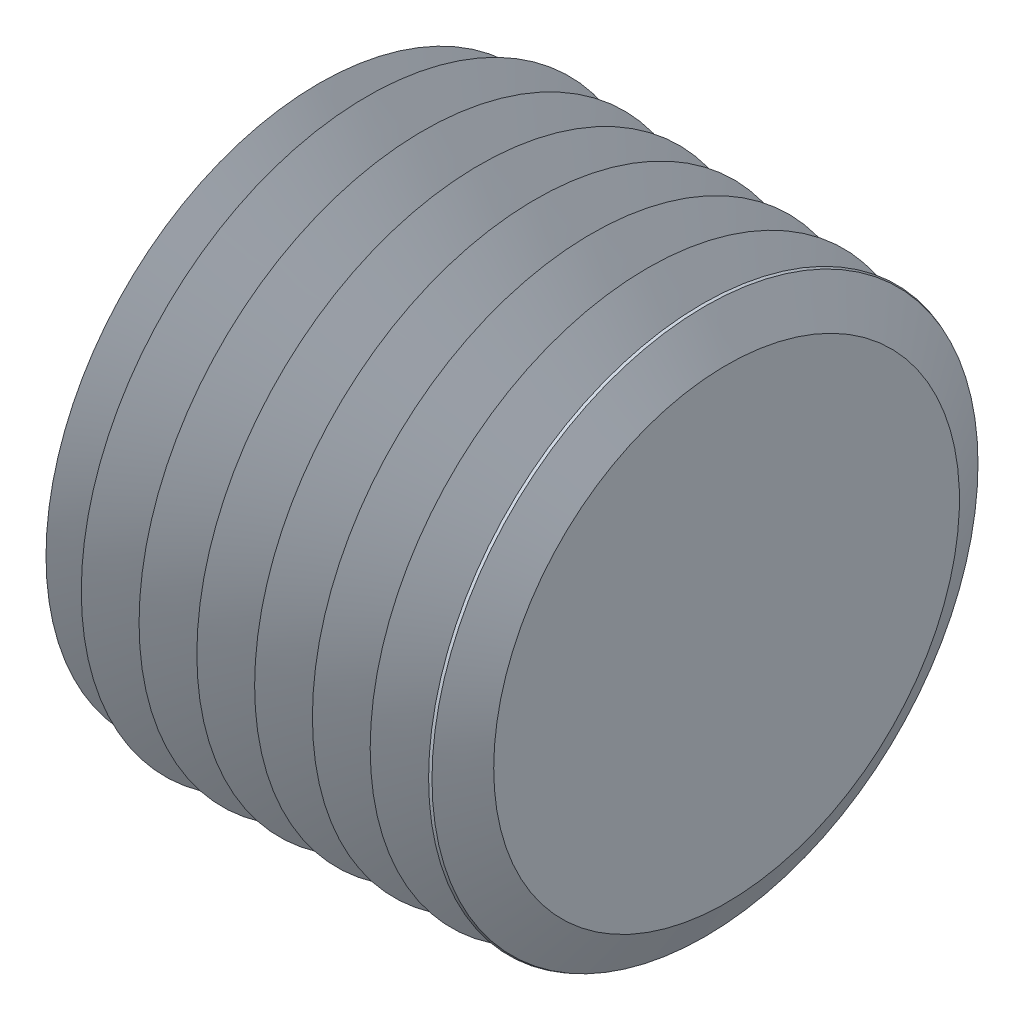
ISO-10303-21;
HEADER;
FILE_DESCRIPTION(('STEP AP214'),'2;1');
FILE_NAME('part.step','',(''),(''),'','','');
FILE_SCHEMA(('AUTOMOTIVE_DESIGN { 1 0 10303 214 1 1 1 1 }'));
ENDSEC;
DATA;
#1=APPLICATION_CONTEXT('core data for automotive mechanical design processes');
#2=APPLICATION_PROTOCOL_DEFINITION('international standard','automotive_design',2000,#1);
#3=PRODUCT_CONTEXT('',#1,'mechanical');
#4=PRODUCT('Part','Part','',(#3));
#5=PRODUCT_RELATED_PRODUCT_CATEGORY('part','',(#4));
#6=PRODUCT_DEFINITION_FORMATION('','',#4);
#7=PRODUCT_DEFINITION_CONTEXT('part definition',#1,'design');
#8=PRODUCT_DEFINITION('design','',#6,#7);
#9=PRODUCT_DEFINITION_SHAPE('','',#8);
#10=(LENGTH_UNIT() NAMED_UNIT(*) SI_UNIT(.MILLI.,.METRE.));
#11=(NAMED_UNIT(*) PLANE_ANGLE_UNIT() SI_UNIT($,.RADIAN.));
#12=(NAMED_UNIT(*) SI_UNIT($,.STERADIAN.) SOLID_ANGLE_UNIT());
#13=UNCERTAINTY_MEASURE_WITH_UNIT(LENGTH_MEASURE(1.E-05),#10,'distance_accuracy_value','');
#14=(GEOMETRIC_REPRESENTATION_CONTEXT(3) GLOBAL_UNCERTAINTY_ASSIGNED_CONTEXT((#13)) GLOBAL_UNIT_ASSIGNED_CONTEXT((#10,
#11,#12)) REPRESENTATION_CONTEXT('',''));
#15=CARTESIAN_POINT('',(0.,0.,0.));
#16=DIRECTION('',(0.,0.,1.));
#17=DIRECTION('',(1.,0.,0.));
#18=AXIS2_PLACEMENT_3D('',#15,#16,#17);
#19=CARTESIAN_POINT('',(4.953,-3.55599999999998,-6.15917267171492));
#20=DIRECTION('',(-1.,0.,0.));
#21=DIRECTION('',(0.,0.,1.));
#22=AXIS2_PLACEMENT_3D('',#19,#20,#21);
#23=PLANE('',#22);
#24=DIRECTION('',(0.,-0.86602540378444,0.499999999999998));
#25=VECTOR('',#24,1.);
#26=CARTESIAN_POINT('',(4.953,3.46951871435368,1.90326757659504));
#27=LINE('',#26,#25);
#28=CARTESIAN_POINT('',(4.953,0.,3.90639514028556));
#29=VERTEX_POINT('',#28);
#30=CARTESIAN_POINT('',(4.953,3.38303742870737,1.9531975701428));
#31=VERTEX_POINT('',#30);
#32=EDGE_CURVE('E86',#29,#31,#27,.F.);
#33=ORIENTED_EDGE('',*,*,#32,.T.);
#34=DIRECTION('',(0.,0.,1.));
#35=VECTOR('',#34,1.);
#36=CARTESIAN_POINT('',(4.953,3.38303742870738,-2.05305755723831));
#37=LINE('',#36,#35);
#38=CARTESIAN_POINT('',(4.953,3.38303742870737,-1.95319757014278));
#39=VERTEX_POINT('',#38);
#40=EDGE_CURVE('E91',#31,#39,#37,.F.);
#41=ORIENTED_EDGE('',*,*,#40,.T.);
#42=DIRECTION('',(0.,0.866025403784438,0.5));
#43=VECTOR('',#42,1.);
#44=CARTESIAN_POINT('',(4.953,-0.0864812856463134,-3.95632513383333));
#45=LINE('',#44,#43);
#46=CARTESIAN_POINT('',(4.953,0.,-3.90639514028556));
#47=VERTEX_POINT('',#46);
#48=EDGE_CURVE('E96',#39,#47,#45,.F.);
#49=ORIENTED_EDGE('',*,*,#48,.T.);
#50=DIRECTION('',(0.,0.86602540378444,-0.499999999999998));
#51=VECTOR('',#50,1.);
#52=CARTESIAN_POINT('',(4.953,-3.46951871435368,-1.90326757659504));
#53=LINE('',#52,#51);
#54=CARTESIAN_POINT('',(4.953,-3.38303742870737,-1.9531975701428));
#55=VERTEX_POINT('',#54);
#56=EDGE_CURVE('E63',#47,#55,#53,.F.);
#57=ORIENTED_EDGE('',*,*,#56,.T.);
#58=DIRECTION('',(0.,0.,1.));
#59=VECTOR('',#58,1.);
#60=CARTESIAN_POINT('',(4.953,-3.38303742870738,2.05305755723831));
#61=LINE('',#60,#59);
#62=CARTESIAN_POINT('',(4.953,-3.38303742870737,1.95319757014278));
#63=VERTEX_POINT('',#62);
#64=EDGE_CURVE('E61',#55,#63,#61,.T.);
#65=ORIENTED_EDGE('',*,*,#64,.T.);
#66=DIRECTION('',(0.,-0.866025403784438,-0.500000000000001));
#67=VECTOR('',#66,1.);
#68=CARTESIAN_POINT('',(4.953,0.0864812856463139,3.95632513383333));
#69=LINE('',#68,#67);
#70=EDGE_CURVE('E58',#63,#29,#69,.F.);
#71=ORIENTED_EDGE('',*,*,#70,.T.);
#72=EDGE_LOOP('',(#33,#41,#49,#57,#65,#71));
#73=FACE_BOUND('',#72,.T.);
#74=ADVANCED_FACE('F14',(#73),#23,.T.);
#75=CARTESIAN_POINT('',(0.,-3.556,2.05305755723831));
#76=DIRECTION('',(0.034899496702501,-0.999390827019096,0.));
#77=DIRECTION('',(0.999390827019096,0.034899496702501,0.));
#78=AXIS2_PLACEMENT_3D('',#75,#76,#77);
#79=PLANE('',#78);
#80=DIRECTION('',(0.999188016619382,0.0348924144072821,-0.0201451448507203));
#81=VECTOR('',#80,1.);
#82=CARTESIAN_POINT('',(0.,-3.556,2.0530575572383));
#83=LINE('',#82,#81);
#84=CARTESIAN_POINT('',(0.,-3.556,2.05305755723831));
#85=VERTEX_POINT('',#84);
#86=EDGE_CURVE('E68',#85,#63,#83,.T.);
#87=ORIENTED_EDGE('',*,*,#86,.T.);
#88=ORIENTED_EDGE('',*,*,#64,.F.);
#89=DIRECTION('',(-0.999188016619382,-0.034892414407282,-0.0201451448507203));
#90=VECTOR('',#89,1.);
#91=CARTESIAN_POINT('',(4.953,-3.38303742870737,-1.9531975701428));
#92=LINE('',#91,#90);
#93=CARTESIAN_POINT('',(0.,-3.55599999999999,-2.05305755723833));
#94=VERTEX_POINT('',#93);
#95=EDGE_CURVE('E102',#55,#94,#92,.T.);
#96=ORIENTED_EDGE('',*,*,#95,.T.);
#97=DIRECTION('',(0.,0.,-1.));
#98=VECTOR('',#97,1.);
#99=CARTESIAN_POINT('',(0.,-3.55599999999999,0.));
#100=LINE('',#99,#98);
#101=EDGE_CURVE('E82',#94,#85,#100,.F.);
#102=ORIENTED_EDGE('',*,*,#101,.T.);
#103=EDGE_LOOP('',(#87,#88,#96,#102));
#104=FACE_BOUND('',#103,.T.);
#105=ADVANCED_FACE('F80',(#104),#79,.F.);
#106=CARTESIAN_POINT('',(0.,0.,4.10611511447662));
#107=DIRECTION('',(0.034899496702501,-0.499695413509549,0.865497844507676));
#108=DIRECTION('',(0.,-0.866025403784438,-0.500000000000001));
#109=AXIS2_PLACEMENT_3D('',#106,#107,#108);
#110=PLANE('',#109);
#111=DIRECTION('',(0.999188016619382,0.,-0.0402902897014408));
#112=VECTOR('',#111,1.);
#113=CARTESIAN_POINT('',(0.,0.,4.10611511447662));
#114=LINE('',#113,#112);
#115=CARTESIAN_POINT('',(0.,0.,4.10611511447662));
#116=VERTEX_POINT('',#115);
#117=EDGE_CURVE('E77',#116,#29,#114,.T.);
#118=ORIENTED_EDGE('',*,*,#117,.T.);
#119=ORIENTED_EDGE('',*,*,#70,.F.);
#120=ORIENTED_EDGE('',*,*,#86,.F.);
#121=DIRECTION('',(0.,0.866025403784438,0.5));
#122=VECTOR('',#121,1.);
#123=CARTESIAN_POINT('',(0.,-3.556,2.05305755723831));
#124=LINE('',#123,#122);
#125=EDGE_CURVE('E166',#85,#116,#124,.T.);
#126=ORIENTED_EDGE('',*,*,#125,.T.);
#127=EDGE_LOOP('',(#118,#119,#120,#126));
#128=FACE_BOUND('',#127,.T.);
#129=ADVANCED_FACE('F73',(#128),#110,.F.);
#130=CARTESIAN_POINT('',(0.,3.55599999999999,2.05305755723833));
#131=DIRECTION('',(0.034899496702501,0.499695413509546,0.865497844507678));
#132=DIRECTION('',(0.,-0.86602540378444,0.499999999999998));
#133=AXIS2_PLACEMENT_3D('',#130,#131,#132);
#134=PLANE('',#133);
#135=DIRECTION('',(0.999188016619382,-0.034892414407282,-0.0201451448507206));
#136=VECTOR('',#135,1.);
#137=CARTESIAN_POINT('',(0.,3.55599999999999,2.05305755723833));
#138=LINE('',#137,#136);
#139=CARTESIAN_POINT('',(0.,3.55599999999999,2.05305755723833));
#140=VERTEX_POINT('',#139);
#141=EDGE_CURVE('E88',#140,#31,#138,.T.);
#142=ORIENTED_EDGE('',*,*,#141,.T.);
#143=ORIENTED_EDGE('',*,*,#32,.F.);
#144=ORIENTED_EDGE('',*,*,#117,.F.);
#145=DIRECTION('',(0.,0.86602540378444,-0.499999999999998));
#146=VECTOR('',#145,1.);
#147=CARTESIAN_POINT('',(0.,0.,4.10611511447662));
#148=LINE('',#147,#146);
#149=EDGE_CURVE('E163',#116,#140,#148,.T.);
#150=ORIENTED_EDGE('',*,*,#149,.T.);
#151=EDGE_LOOP('',(#142,#143,#144,#150));
#152=FACE_BOUND('',#151,.T.);
#153=ADVANCED_FACE('F191',(#152),#134,.F.);
#154=CARTESIAN_POINT('',(0.,3.556,-2.05305755723831));
#155=DIRECTION('',(0.034899496702501,0.999390827019096,0.));
#156=DIRECTION('',(-0.999390827019096,0.034899496702501,0.));
#157=AXIS2_PLACEMENT_3D('',#154,#155,#156);
#158=PLANE('',#157);
#159=DIRECTION('',(0.999188016619382,-0.0348924144072817,0.0201451448507204));
#160=VECTOR('',#159,1.);
#161=CARTESIAN_POINT('',(0.,3.556,-2.05305755723831));
#162=LINE('',#161,#160);
#163=CARTESIAN_POINT('',(0.,3.556,-2.05305755723831));
#164=VERTEX_POINT('',#163);
#165=EDGE_CURVE('E93',#164,#39,#162,.T.);
#166=ORIENTED_EDGE('',*,*,#165,.T.);
#167=ORIENTED_EDGE('',*,*,#40,.F.);
#168=ORIENTED_EDGE('',*,*,#141,.F.);
#169=DIRECTION('',(0.,0.,-1.));
#170=VECTOR('',#169,1.);
#171=CARTESIAN_POINT('',(0.,3.55599999999999,0.));
#172=LINE('',#171,#170);
#173=EDGE_CURVE('E160',#140,#164,#172,.T.);
#174=ORIENTED_EDGE('',*,*,#173,.T.);
#175=EDGE_LOOP('',(#166,#167,#168,#174));
#176=FACE_BOUND('',#175,.T.);
#177=ADVANCED_FACE('F189',(#176),#158,.F.);
#178=CARTESIAN_POINT('',(0.,0.,-4.10611511447662));
#179=DIRECTION('',(0.034899496702501,0.499695413509548,-0.865497844507676));
#180=DIRECTION('',(0.,0.866025403784438,0.5));
#181=AXIS2_PLACEMENT_3D('',#178,#179,#180);
#182=PLANE('',#181);
#183=DIRECTION('',(0.999188016619382,0.,0.0402902897014406));
#184=VECTOR('',#183,1.);
#185=CARTESIAN_POINT('',(0.,0.,-4.10611511447662));
#186=LINE('',#185,#184);
#187=CARTESIAN_POINT('',(0.,0.,-4.10611511447662));
#188=VERTEX_POINT('',#187);
#189=EDGE_CURVE('E98',#188,#47,#186,.T.);
#190=ORIENTED_EDGE('',*,*,#189,.T.);
#191=ORIENTED_EDGE('',*,*,#48,.F.);
#192=ORIENTED_EDGE('',*,*,#165,.F.);
#193=DIRECTION('',(0.,-0.866025403784438,-0.5));
#194=VECTOR('',#193,1.);
#195=CARTESIAN_POINT('',(0.,3.556,-2.05305755723831));
#196=LINE('',#195,#194);
#197=EDGE_CURVE('E157',#164,#188,#196,.T.);
#198=ORIENTED_EDGE('',*,*,#197,.T.);
#199=EDGE_LOOP('',(#190,#191,#192,#198));
#200=FACE_BOUND('',#199,.T.);
#201=ADVANCED_FACE('F186',(#200),#182,.F.);
#202=CARTESIAN_POINT('',(0.,-3.55599999999999,-2.05305755723833));
#203=DIRECTION('',(0.034899496702501,-0.499695413509546,-0.865497844507678));
#204=DIRECTION('',(0.,0.86602540378444,-0.499999999999998));
#205=AXIS2_PLACEMENT_3D('',#202,#203,#204);
#206=PLANE('',#205);
#207=ORIENTED_EDGE('',*,*,#95,.F.);
#208=ORIENTED_EDGE('',*,*,#56,.F.);
#209=ORIENTED_EDGE('',*,*,#189,.F.);
#210=DIRECTION('',(0.,-0.86602540378444,0.499999999999998));
#211=VECTOR('',#210,1.);
#212=CARTESIAN_POINT('',(0.,0.,-4.10611511447662));
#213=LINE('',#212,#211);
#214=EDGE_CURVE('E149',#188,#94,#213,.T.);
#215=ORIENTED_EDGE('',*,*,#214,.T.);
#216=EDGE_LOOP('',(#207,#208,#209,#215));
#217=FACE_BOUND('',#216,.T.);
#218=ADVANCED_FACE('F183',(#217),#206,.F.);
#219=CARTESIAN_POINT('',(0.,0.,0.));
#220=DIRECTION('',(1.,0.,0.));
#221=DIRECTION('',(0.,0.,-1.));
#222=AXIS2_PLACEMENT_3D('',#219,#220,#221);
#223=PLANE('',#222);
#224=ORIENTED_EDGE('',*,*,#197,.F.);
#225=ORIENTED_EDGE('',*,*,#173,.F.);
#226=ORIENTED_EDGE('',*,*,#149,.F.);
#227=ORIENTED_EDGE('',*,*,#125,.F.);
#228=ORIENTED_EDGE('',*,*,#101,.F.);
#229=ORIENTED_EDGE('',*,*,#214,.F.);
#230=EDGE_LOOP('',(#224,#225,#226,#227,#228,#229));
#231=FACE_BOUND('',#230,.T.);
#232=CARTESIAN_POINT('',(0.,0.,0.));
#233=DIRECTION('',(1.,0.,0.));
#234=DIRECTION('',(0.,-1.,0.));
#235=AXIS2_PLACEMENT_3D('',#232,#233,#234);
#236=CIRCLE('',#235,5.974158627836);
#237=CARTESIAN_POINT('',(0.,-5.974158627836,0.));
#238=VERTEX_POINT('',#237);
#239=CARTESIAN_POINT('',(0.,5.97415862783601,0.));
#240=VERTEX_POINT('',#239);
#241=EDGE_CURVE('E134',#238,#240,#236,.T.);
#242=ORIENTED_EDGE('',*,*,#241,.F.);
#243=CARTESIAN_POINT('',(0.,0.,0.));
#244=DIRECTION('',(1.,0.,0.));
#245=DIRECTION('',(0.,1.,0.));
#246=AXIS2_PLACEMENT_3D('',#243,#244,#245);
#247=CIRCLE('',#246,5.974158627836);
#248=EDGE_CURVE('E33',#240,#238,#247,.T.);
#249=ORIENTED_EDGE('',*,*,#248,.F.);
#250=EDGE_LOOP('',(#242,#249));
#251=FACE_BOUND('',#250,.T.);
#252=ADVANCED_FACE('F120',(#231,#251),#223,.F.);
#253=CARTESIAN_POINT('',(0.857249999999997,0.,0.));
#254=DIRECTION('',(-1.,0.,0.));
#255=DIRECTION('',(0.,-1.,0.));
#256=AXIS2_PLACEMENT_3D('',#253,#254,#255);
#257=TOROIDAL_SURFACE('',#256,5.974158627836,0.857250000000001);
#258=CARTESIAN_POINT('',(0.187509807176411,0.,0.));
#259=DIRECTION('',(-1.,0.,0.));
#260=DIRECTION('',(0.,0.,1.));
#261=AXIS2_PLACEMENT_3D('',#258,#259,#260);
#262=CIRCLE('',#261,6.50925267223101);
#263=CARTESIAN_POINT('',(0.187509807176411,0.,6.50925267223101));
#264=VERTEX_POINT('',#263);
#265=EDGE_CURVE('E131',#264,#264,#262,.F.);
#266=ORIENTED_EDGE('',*,*,#265,.F.);
#267=EDGE_LOOP('',(#266));
#268=FACE_BOUND('',#267,.T.);
#269=ORIENTED_EDGE('',*,*,#241,.T.);
#270=ORIENTED_EDGE('',*,*,#248,.T.);
#271=EDGE_LOOP('',(#269,#270));
#272=FACE_BOUND('',#271,.T.);
#273=ADVANCED_FACE('F108',(#268,#272),#257,.T.);
#274=CARTESIAN_POINT('',(0.187509807290098,0.,0.));
#275=DIRECTION('',(-1.,0.,0.));
#276=DIRECTION('',(0.,0.,1.));
#277=AXIS2_PLACEMENT_3D('',#274,#275,#276);
#278=CONICAL_SURFACE('',#277,6.50925267200364,1.07747138381736);
#279=CARTESIAN_POINT('',(0.633070918979683,0.,0.));
#280=DIRECTION('',(1.,0.,0.));
#281=DIRECTION('',(0.,0.,-1.));
#282=AXIS2_PLACEMENT_3D('',#279,#280,#281);
#283=CIRCLE('',#282,5.68055869530326);
#284=CARTESIAN_POINT('',(0.633070918979683,0.,-5.68055869530326));
#285=VERTEX_POINT('',#284);
#286=EDGE_CURVE('E129',#285,#285,#283,.T.);
#287=ORIENTED_EDGE('',*,*,#286,.F.);
#288=EDGE_LOOP('',(#287));
#289=FACE_BOUND('',#288,.T.);
#290=ORIENTED_EDGE('',*,*,#265,.T.);
#291=EDGE_LOOP('',(#290));
#292=FACE_BOUND('',#291,.T.);
#293=ADVANCED_FACE('F119',(#289,#292),#278,.T.);
#294=CARTESIAN_POINT('',(1.33684210635465,0.,0.));
#295=DIRECTION('',(1.,0.,0.));
#296=DIRECTION('',(0.,0.,-1.));
#297=AXIS2_PLACEMENT_3D('',#294,#295,#296);
#298=CONICAL_SURFACE('',#297,6.81715577843534,1.01638486004312);
#299=ORIENTED_EDGE('',*,*,#286,.T.);
#300=EDGE_LOOP('',(#299));
#301=FACE_BOUND('',#300,.T.);
#302=CARTESIAN_POINT('',(1.33684210527463,0.,0.));
#303=DIRECTION('',(-1.,0.,0.));
#304=DIRECTION('',(0.,0.,1.));
#305=AXIS2_PLACEMENT_3D('',#302,#303,#304);
#306=CIRCLE('',#305,6.81715577962905);
#307=CARTESIAN_POINT('',(1.33684210527463,0.,6.81715577962905));
#308=VERTEX_POINT('',#307);
#309=EDGE_CURVE('E258',#308,#308,#306,.F.);
#310=ORIENTED_EDGE('',*,*,#309,.F.);
#311=EDGE_LOOP('',(#310));
#312=FACE_BOUND('',#311,.T.);
#313=ADVANCED_FACE('F265',(#301,#312),#298,.T.);
#314=CARTESIAN_POINT('',(1.33684210527463,0.,0.));
#315=DIRECTION('',(-1.,0.,0.));
#316=DIRECTION('',(0.,0.,1.));
#317=AXIS2_PLACEMENT_3D('',#314,#315,#316);
#318=CONICAL_SURFACE('',#317,6.81715577951536,1.07747138380049);
#319=CARTESIAN_POINT('',(1.96991302431115,0.,0.));
#320=DIRECTION('',(1.,0.,0.));
#321=DIRECTION('',(0.,0.,-1.));
#322=AXIS2_PLACEMENT_3D('',#319,#320,#321);
#323=CIRCLE('',#322,5.63971447496669);
#324=CARTESIAN_POINT('',(1.96991302431115,0.,-5.63971447496669));
#325=VERTEX_POINT('',#324);
#326=EDGE_CURVE('E256',#325,#325,#323,.T.);
#327=ORIENTED_EDGE('',*,*,#326,.F.);
#328=EDGE_LOOP('',(#327));
#329=FACE_BOUND('',#328,.T.);
#330=ORIENTED_EDGE('',*,*,#309,.T.);
#331=EDGE_LOOP('',(#330));
#332=FACE_BOUND('',#331,.T.);
#333=ADVANCED_FACE('F274',(#329,#332),#318,.T.);
#334=CARTESIAN_POINT('',(2.6736842119135,0.,0.));
#335=DIRECTION('',(1.,0.,0.));
#336=DIRECTION('',(0.,0.,-1.));
#337=AXIS2_PLACEMENT_3D('',#334,#335,#336);
#338=CONICAL_SURFACE('',#337,6.77631155849667,1.01638486006036);
#339=ORIENTED_EDGE('',*,*,#326,.T.);
#340=EDGE_LOOP('',(#339));
#341=FACE_BOUND('',#340,.T.);
#342=CARTESIAN_POINT('',(2.67368421054925,0.,0.));
#343=DIRECTION('',(-1.,0.,0.));
#344=DIRECTION('',(0.,0.,1.));
#345=AXIS2_PLACEMENT_3D('',#342,#343,#344);
#346=CIRCLE('',#345,6.77631155917879);
#347=CARTESIAN_POINT('',(2.67368421054925,0.,6.77631155917879));
#348=VERTEX_POINT('',#347);
#349=EDGE_CURVE('E253',#348,#348,#346,.F.);
#350=ORIENTED_EDGE('',*,*,#349,.F.);
#351=EDGE_LOOP('',(#350));
#352=FACE_BOUND('',#351,.T.);
#353=ADVANCED_FACE('F278',(#341,#352),#338,.T.);
#354=CARTESIAN_POINT('',(2.67368421054925,0.,0.));
#355=DIRECTION('',(-1.,0.,0.));
#356=DIRECTION('',(0.,0.,1.));
#357=AXIS2_PLACEMENT_3D('',#354,#355,#356);
#358=CONICAL_SURFACE('',#357,6.77631155917879,1.07747138380331);
#359=CARTESIAN_POINT('',(3.30675512958578,0.,0.));
#360=DIRECTION('',(1.,0.,0.));
#361=DIRECTION('',(0.,0.,-1.));
#362=AXIS2_PLACEMENT_3D('',#359,#360,#361);
#363=CIRCLE('',#362,5.59887025457328);
#364=CARTESIAN_POINT('',(3.30675512958578,0.,-5.59887025457328));
#365=VERTEX_POINT('',#364);
#366=EDGE_CURVE('E250',#365,#365,#363,.T.);
#367=ORIENTED_EDGE('',*,*,#366,.F.);
#368=EDGE_LOOP('',(#367));
#369=FACE_BOUND('',#368,.T.);
#370=ORIENTED_EDGE('',*,*,#349,.T.);
#371=EDGE_LOOP('',(#370));
#372=FACE_BOUND('',#371,.T.);
#373=ADVANCED_FACE('F284',(#369,#372),#358,.T.);
#374=CARTESIAN_POINT('',(4.01052631713128,0.,0.));
#375=DIRECTION('',(1.,0.,0.));
#376=DIRECTION('',(0.,0.,-1.));
#377=AXIS2_PLACEMENT_3D('',#374,#375,#376);
#378=CONICAL_SURFACE('',#377,6.73546733798958,1.01638486005174);
#379=ORIENTED_EDGE('',*,*,#366,.T.);
#380=EDGE_LOOP('',(#379));
#381=FACE_BOUND('',#380,.T.);
#382=CARTESIAN_POINT('',(4.01052631576704,0.,0.));
#383=DIRECTION('',(-1.,0.,0.));
#384=DIRECTION('',(0.,0.,1.));
#385=AXIS2_PLACEMENT_3D('',#382,#383,#384);
#386=CIRCLE('',#385,6.73546733872854);
#387=CARTESIAN_POINT('',(4.01052631576704,0.,6.73546733872854));
#388=VERTEX_POINT('',#387);
#389=EDGE_CURVE('E247',#388,#388,#386,.F.);
#390=ORIENTED_EDGE('',*,*,#389,.F.);
#391=EDGE_LOOP('',(#390));
#392=FACE_BOUND('',#391,.T.);
#393=ADVANCED_FACE('F288',(#381,#392),#378,.T.);
#394=CARTESIAN_POINT('',(4.01052631582388,0.,0.));
#395=DIRECTION('',(-1.,0.,0.));
#396=DIRECTION('',(0.,0.,1.));
#397=AXIS2_PLACEMENT_3D('',#394,#395,#396);
#398=CONICAL_SURFACE('',#397,6.73546733861485,1.07747138380331);
#399=CARTESIAN_POINT('',(4.64359723486041,0.,0.));
#400=DIRECTION('',(1.,0.,0.));
#401=DIRECTION('',(0.,0.,-1.));
#402=AXIS2_PLACEMENT_3D('',#399,#400,#401);
#403=CIRCLE('',#402,5.55802603406619);
#404=CARTESIAN_POINT('',(4.64359723486041,0.,-5.55802603406619));
#405=VERTEX_POINT('',#404);
#406=EDGE_CURVE('E244',#405,#405,#403,.T.);
#407=ORIENTED_EDGE('',*,*,#406,.F.);
#408=EDGE_LOOP('',(#407));
#409=FACE_BOUND('',#408,.T.);
#410=ORIENTED_EDGE('',*,*,#389,.T.);
#411=EDGE_LOOP('',(#410));
#412=FACE_BOUND('',#411,.T.);
#413=ADVANCED_FACE('F292',(#409,#412),#398,.T.);
#414=CARTESIAN_POINT('',(5.34736842229222,0.,0.));
#415=DIRECTION('',(1.,0.,0.));
#416=DIRECTION('',(0.,0.,-1.));
#417=AXIS2_PLACEMENT_3D('',#414,#415,#416);
#418=CONICAL_SURFACE('',#417,6.69462311742564,1.01638486008789);
#419=ORIENTED_EDGE('',*,*,#406,.T.);
#420=EDGE_LOOP('',(#419));
#421=FACE_BOUND('',#420,.T.);
#422=CARTESIAN_POINT('',(5.34736842104166,0.,0.));
#423=DIRECTION('',(-1.,0.,0.));
#424=DIRECTION('',(0.,0.,1.));
#425=AXIS2_PLACEMENT_3D('',#422,#423,#424);
#426=CIRCLE('',#425,6.69462311833513);
#427=CARTESIAN_POINT('',(5.34736842104166,0.,6.69462311833513));
#428=VERTEX_POINT('',#427);
#429=EDGE_CURVE('E241',#428,#428,#426,.F.);
#430=ORIENTED_EDGE('',*,*,#429,.F.);
#431=EDGE_LOOP('',(#430));
#432=FACE_BOUND('',#431,.T.);
#433=ADVANCED_FACE('F296',(#421,#432),#418,.T.);
#434=CARTESIAN_POINT('',(5.34736842109851,0.,0.));
#435=DIRECTION('',(-1.,0.,0.));
#436=DIRECTION('',(0.,0.,1.));
#437=AXIS2_PLACEMENT_3D('',#434,#435,#436);
#438=CONICAL_SURFACE('',#437,6.69462311822144,1.07747138380049);
#439=CARTESIAN_POINT('',(5.98043934007819,0.,0.));
#440=DIRECTION('',(1.,0.,0.));
#441=DIRECTION('',(0.,0.,-1.));
#442=AXIS2_PLACEMENT_3D('',#439,#440,#441);
#443=CIRCLE('',#442,5.51718181372962);
#444=CARTESIAN_POINT('',(5.98043934007819,0.,-5.51718181372962));
#445=VERTEX_POINT('',#444);
#446=EDGE_CURVE('E238',#445,#445,#443,.T.);
#447=ORIENTED_EDGE('',*,*,#446,.F.);
#448=EDGE_LOOP('',(#447));
#449=FACE_BOUND('',#448,.T.);
#450=ORIENTED_EDGE('',*,*,#429,.T.);
#451=EDGE_LOOP('',(#450));
#452=FACE_BOUND('',#451,.T.);
#453=ADVANCED_FACE('F300',(#449,#452),#438,.T.);
#454=CARTESIAN_POINT('',(6.68421052762369,0.,0.));
#455=DIRECTION('',(1.,0.,0.));
#456=DIRECTION('',(0.,0.,-1.));
#457=AXIS2_PLACEMENT_3D('',#454,#455,#456);
#458=CONICAL_SURFACE('',#457,6.65377889714591,1.01638486005174);
#459=ORIENTED_EDGE('',*,*,#446,.T.);
#460=EDGE_LOOP('',(#459));
#461=FACE_BOUND('',#460,.T.);
#462=CARTESIAN_POINT('',(6.68421052631629,0.,0.));
#463=DIRECTION('',(-1.,0.,0.));
#464=DIRECTION('',(0.,0.,1.));
#465=AXIS2_PLACEMENT_3D('',#462,#463,#464);
#466=CIRCLE('',#465,6.65377889794172);
#467=CARTESIAN_POINT('',(6.68421052631629,0.,6.65377889794172));
#468=VERTEX_POINT('',#467);
#469=EDGE_CURVE('E235',#468,#468,#466,.F.);
#470=ORIENTED_EDGE('',*,*,#469,.F.);
#471=EDGE_LOOP('',(#470));
#472=FACE_BOUND('',#471,.T.);
#473=ADVANCED_FACE('F304',(#461,#472),#458,.T.);
#474=CARTESIAN_POINT('',(6.68421052642998,0.,0.));
#475=DIRECTION('',(-1.,0.,0.));
#476=DIRECTION('',(0.,0.,1.));
#477=AXIS2_PLACEMENT_3D('',#474,#475,#476);
#478=CONICAL_SURFACE('',#477,6.65377889777119,1.07747138380331);
#479=CARTESIAN_POINT('',(7.31728144535282,0.,0.));
#480=DIRECTION('',(1.,0.,0.));
#481=DIRECTION('',(0.,0.,-1.));
#482=AXIS2_PLACEMENT_3D('',#479,#480,#481);
#483=CIRCLE('',#482,5.47633759333621);
#484=CARTESIAN_POINT('',(7.31728144535282,0.,-5.47633759333621));
#485=VERTEX_POINT('',#484);
#486=EDGE_CURVE('E232',#485,#485,#483,.T.);
#487=ORIENTED_EDGE('',*,*,#486,.F.);
#488=EDGE_LOOP('',(#487));
#489=FACE_BOUND('',#488,.T.);
#490=ORIENTED_EDGE('',*,*,#469,.T.);
#491=EDGE_LOOP('',(#490));
#492=FACE_BOUND('',#491,.T.);
#493=ADVANCED_FACE('F308',(#489,#492),#478,.T.);
#494=CARTESIAN_POINT('',(8.02105263289832,0.,0.));
#495=DIRECTION('',(1.,0.,0.));
#496=DIRECTION('',(0.,0.,-1.));
#497=AXIS2_PLACEMENT_3D('',#494,#495,#496);
#498=CONICAL_SURFACE('',#497,6.6129346767525,1.01638486005174);
#499=ORIENTED_EDGE('',*,*,#486,.T.);
#500=EDGE_LOOP('',(#499));
#501=FACE_BOUND('',#500,.T.);
#502=CARTESIAN_POINT('',(8.02105263153408,0.,0.));
#503=DIRECTION('',(-1.,0.,0.));
#504=DIRECTION('',(0.,0.,1.));
#505=AXIS2_PLACEMENT_3D('',#502,#503,#504);
#506=CIRCLE('',#505,6.61293467754831);
#507=CARTESIAN_POINT('',(8.02105263153408,0.,6.61293467754831));
#508=VERTEX_POINT('',#507);
#509=EDGE_CURVE('E229',#508,#508,#506,.F.);
#510=ORIENTED_EDGE('',*,*,#509,.F.);
#511=EDGE_LOOP('',(#510));
#512=FACE_BOUND('',#511,.T.);
#513=ADVANCED_FACE('F312',(#501,#512),#498,.T.);
#514=CARTESIAN_POINT('',(8.02105263159092,0.,0.));
#515=DIRECTION('',(-1.,0.,0.));
#516=DIRECTION('',(0.,0.,1.));
#517=AXIS2_PLACEMENT_3D('',#514,#515,#516);
#518=CONICAL_SURFACE('',#517,6.61293467743462,1.07747138380331);
#519=CARTESIAN_POINT('',(8.65412355062745,0.,0.));
#520=DIRECTION('',(1.,0.,0.));
#521=DIRECTION('',(0.,0.,-1.));
#522=AXIS2_PLACEMENT_3D('',#519,#520,#521);
#523=CIRCLE('',#522,5.4354933729428);
#524=CARTESIAN_POINT('',(8.65412355062745,0.,-5.4354933729428));
#525=VERTEX_POINT('',#524);
#526=EDGE_CURVE('E226',#525,#525,#523,.T.);
#527=ORIENTED_EDGE('',*,*,#526,.F.);
#528=EDGE_LOOP('',(#527));
#529=FACE_BOUND('',#528,.T.);
#530=ORIENTED_EDGE('',*,*,#509,.T.);
#531=EDGE_LOOP('',(#530));
#532=FACE_BOUND('',#531,.T.);
#533=ADVANCED_FACE('F315',(#529,#532),#518,.T.);
#534=CARTESIAN_POINT('',(9.33338249160443,0.,0.));
#535=DIRECTION('',(1.,0.,0.));
#536=DIRECTION('',(0.,0.,-1.));
#537=AXIS2_PLACEMENT_3D('',#534,#535,#536);
#538=CONICAL_SURFACE('',#537,6.53250294777763,1.01638486006462);
#539=ORIENTED_EDGE('',*,*,#526,.T.);
#540=EDGE_LOOP('',(#539));
#541=FACE_BOUND('',#540,.T.);
#542=CARTESIAN_POINT('',(9.33338249047571,0.,0.));
#543=DIRECTION('',(-1.,0.,0.));
#544=DIRECTION('',(0.,-1.,0.));
#545=AXIS2_PLACEMENT_3D('',#542,#543,#544);
#546=CIRCLE('',#545,6.53250294872932);
#547=CARTESIAN_POINT('',(9.33338249047571,-6.53250294872931,0.));
#548=VERTEX_POINT('',#547);
#549=EDGE_CURVE('E223',#548,#548,#546,.F.);
#550=ORIENTED_EDGE('',*,*,#549,.F.);
#551=EDGE_LOOP('',(#550));
#552=FACE_BOUND('',#551,.T.);
#553=ADVANCED_FACE('F217',(#541,#552),#538,.T.);
#554=CARTESIAN_POINT('',(9.04875,0.,0.));
#555=DIRECTION('',(-1.,0.,0.));
#556=DIRECTION('',(0.,-1.,0.));
#557=AXIS2_PLACEMENT_3D('',#554,#555,#556);
#558=TOROIDAL_SURFACE('',#557,5.72388566727561,0.857249999999999);
#559=ORIENTED_EDGE('',*,*,#549,.T.);
#560=EDGE_LOOP('',(#559));
#561=FACE_BOUND('',#560,.T.);
#562=CARTESIAN_POINT('',(9.39146817967185,0.,0.));
#563=DIRECTION('',(-1.,0.,0.));
#564=DIRECTION('',(0.,0.,1.));
#565=AXIS2_PLACEMENT_3D('',#562,#563,#564);
#566=CIRCLE('',#565,6.50964759813633);
#567=CARTESIAN_POINT('',(9.39146817967185,0.,6.50964759813633));
#568=VERTEX_POINT('',#567);
#569=EDGE_CURVE('E25',#568,#568,#566,.F.);
#570=ORIENTED_EDGE('',*,*,#569,.F.);
#571=EDGE_LOOP('',(#570));
#572=FACE_BOUND('',#571,.T.);
#573=ADVANCED_FACE('F209',(#561,#572),#558,.T.);
#574=CARTESIAN_POINT('',(9.39146817967185,0.,0.));
#575=DIRECTION('',(-1.,0.,0.));
#576=DIRECTION('',(0.,0.,1.));
#577=AXIS2_PLACEMENT_3D('',#574,#575,#576);
#578=CONICAL_SURFACE('',#577,6.50964759813633,1.07747138380385);
#579=ORIENTED_EDGE('',*,*,#569,.T.);
#580=EDGE_LOOP('',(#579));
#581=FACE_BOUND('',#580,.T.);
#582=CARTESIAN_POINT('',(9.90600000130826,0.,0.));
#583=DIRECTION('',(-1.,0.,0.));
#584=DIRECTION('',(0.,0.,1.));
#585=AXIS2_PLACEMENT_3D('',#582,#583,#584);
#586=CIRCLE('',#585,5.55267579716201);
#587=CARTESIAN_POINT('',(9.90600000130826,0.,5.55267579716201));
#588=VERTEX_POINT('',#587);
#589=EDGE_CURVE('E9',#588,#588,#586,.T.);
#590=ORIENTED_EDGE('',*,*,#589,.T.);
#591=EDGE_LOOP('',(#590));
#592=FACE_BOUND('',#591,.T.);
#593=ADVANCED_FACE('F203',(#581,#592),#578,.T.);
#594=CARTESIAN_POINT('',(9.906,5.72388566727562,0.));
#595=DIRECTION('',(-1.,0.,0.));
#596=DIRECTION('',(0.,0.,1.));
#597=AXIS2_PLACEMENT_3D('',#594,#595,#596);
#598=PLANE('',#597);
#599=ORIENTED_EDGE('',*,*,#589,.F.);
#600=EDGE_LOOP('',(#599));
#601=FACE_BOUND('',#600,.T.);
#602=ADVANCED_FACE('F201',(#601),#598,.F.);
#603=CLOSED_SHELL('',(#74,#105,#129,#153,#177,#201,#218,#252,#273,#293,#313,#333,#353,#373,#393,
#413,#433,#453,#473,#493,#513,#533,#553,#573,#593,#602));
#604=MANIFOLD_SOLID_BREP('B1',#603);
#605=ADVANCED_BREP_SHAPE_REPRESENTATION('',(#18,#604),#14);
#606=SHAPE_DEFINITION_REPRESENTATION(#9,#605);
ENDSEC;
END-ISO-10303-21;
